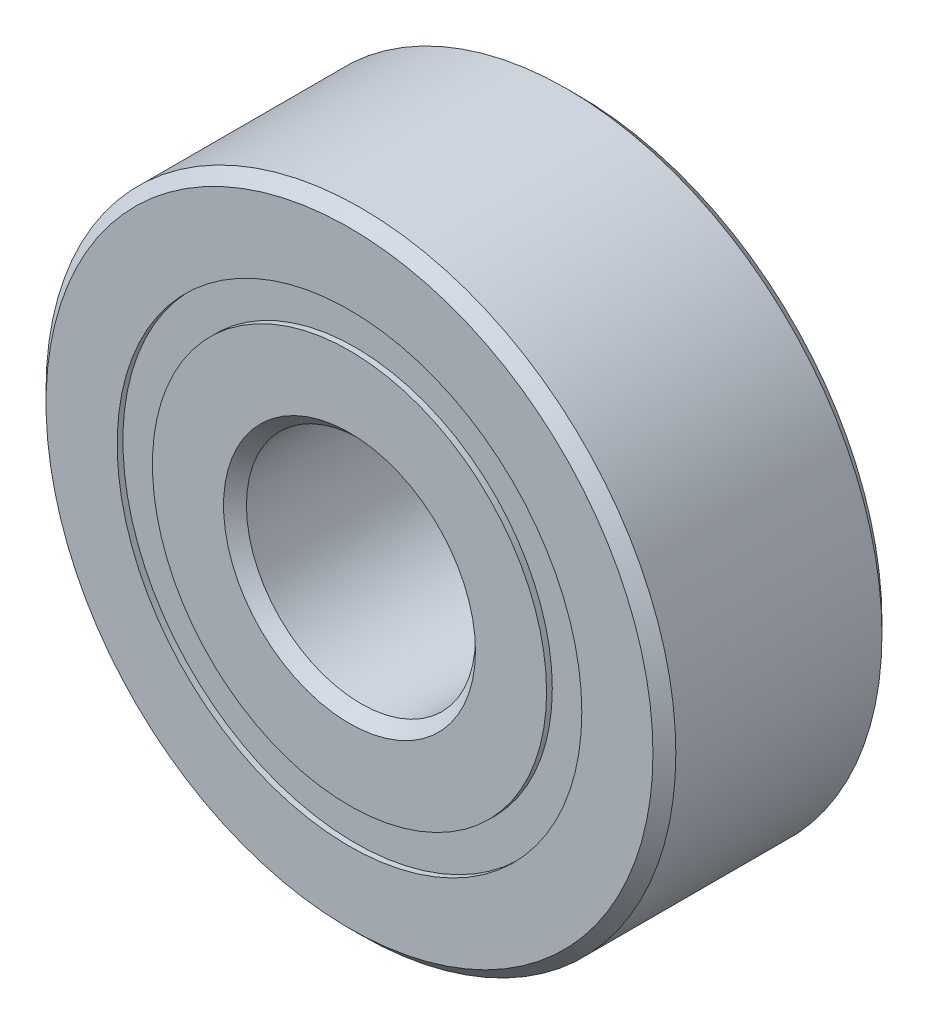
ISO-10303-21;
HEADER;
FILE_DESCRIPTION(('STEP AP214'),'2;1');
FILE_NAME('part.step','',(''),(''),'','','');
FILE_SCHEMA(('AUTOMOTIVE_DESIGN { 1 0 10303 214 1 1 1 1 }'));
ENDSEC;
DATA;
#1=APPLICATION_CONTEXT('core data for automotive mechanical design processes');
#2=APPLICATION_PROTOCOL_DEFINITION('international standard','automotive_design',2000,#1);
#3=PRODUCT_CONTEXT('',#1,'mechanical');
#4=PRODUCT('Part','Part','',(#3));
#5=PRODUCT_RELATED_PRODUCT_CATEGORY('part','',(#4));
#6=PRODUCT_DEFINITION_FORMATION('','',#4);
#7=PRODUCT_DEFINITION_CONTEXT('part definition',#1,'design');
#8=PRODUCT_DEFINITION('design','',#6,#7);
#9=PRODUCT_DEFINITION_SHAPE('','',#8);
#10=(LENGTH_UNIT() NAMED_UNIT(*) SI_UNIT(.MILLI.,.METRE.));
#11=(NAMED_UNIT(*) PLANE_ANGLE_UNIT() SI_UNIT($,.RADIAN.));
#12=(NAMED_UNIT(*) SI_UNIT($,.STERADIAN.) SOLID_ANGLE_UNIT());
#13=UNCERTAINTY_MEASURE_WITH_UNIT(LENGTH_MEASURE(1.E-05),#10,'distance_accuracy_value','');
#14=(GEOMETRIC_REPRESENTATION_CONTEXT(3) GLOBAL_UNCERTAINTY_ASSIGNED_CONTEXT((#13)) GLOBAL_UNIT_ASSIGNED_CONTEXT((#10,
#11,#12)) REPRESENTATION_CONTEXT('',''));
#15=CARTESIAN_POINT('',(0.,0.,0.));
#16=DIRECTION('',(0.,0.,1.));
#17=DIRECTION('',(1.,0.,0.));
#18=AXIS2_PLACEMENT_3D('',#15,#16,#17);
#19=CARTESIAN_POINT('',(0.,4.05769230769231,-1.9));
#20=DIRECTION('',(0.,0.,1.));
#21=DIRECTION('',(1.,0.,0.));
#22=AXIS2_PLACEMENT_3D('',#19,#20,#21);
#23=PLANE('',#22);
#24=CARTESIAN_POINT('',(0.,0.,-1.9));
#25=DIRECTION('',(0.,0.,1.));
#26=DIRECTION('',(1.,0.,0.));
#27=AXIS2_PLACEMENT_3D('',#24,#25,#26);
#28=CIRCLE('',#27,4.05769230769231);
#29=CARTESIAN_POINT('',(4.05769230769231,0.,-1.9));
#30=VERTEX_POINT('',#29);
#31=EDGE_CURVE('E59',#30,#30,#28,.T.);
#32=ORIENTED_EDGE('',*,*,#31,.F.);
#33=EDGE_LOOP('',(#32));
#34=FACE_BOUND('',#33,.T.);
#35=CARTESIAN_POINT('',(0.,0.,-1.9));
#36=DIRECTION('',(0.,0.,1.));
#37=DIRECTION('',(1.,0.,0.));
#38=AXIS2_PLACEMENT_3D('',#35,#36,#37);
#39=CIRCLE('',#38,3.44230769230769);
#40=CARTESIAN_POINT('',(3.44230769230769,0.,-1.9));
#41=VERTEX_POINT('',#40);
#42=EDGE_CURVE('E11',#41,#41,#39,.T.);
#43=ORIENTED_EDGE('',*,*,#42,.T.);
#44=EDGE_LOOP('',(#43));
#45=FACE_BOUND('',#44,.T.);
#46=ADVANCED_FACE('F45',(#34,#45),#23,.F.);
#47=CARTESIAN_POINT('',(0.,0.,2.));
#48=DIRECTION('',(0.,0.,1.));
#49=DIRECTION('',(1.,0.,0.));
#50=AXIS2_PLACEMENT_3D('',#47,#48,#49);
#51=CYLINDRICAL_SURFACE('',#50,3.44230769230769);
#52=ORIENTED_EDGE('',*,*,#42,.F.);
#53=EDGE_LOOP('',(#52));
#54=FACE_BOUND('',#53,.T.);
#55=CARTESIAN_POINT('',(0.,0.,-0.940637025107528));
#56=DIRECTION('',(0.,0.,1.));
#57=DIRECTION('',(1.,0.,0.));
#58=AXIS2_PLACEMENT_3D('',#55,#56,#57);
#59=CIRCLE('',#58,3.44230769230769);
#60=CARTESIAN_POINT('',(3.44230769230769,0.,-0.940637025107528));
#61=VERTEX_POINT('',#60);
#62=EDGE_CURVE('E51',#61,#61,#59,.T.);
#63=ORIENTED_EDGE('',*,*,#62,.T.);
#64=EDGE_LOOP('',(#63));
#65=FACE_BOUND('',#64,.T.);
#66=ADVANCED_FACE('F68',(#54,#65),#51,.F.);
#67=CARTESIAN_POINT('',(0.,4.05769230769231,-0.940637025107528));
#68=DIRECTION('',(0.,0.,-1.));
#69=DIRECTION('',(-1.,0.,0.));
#70=AXIS2_PLACEMENT_3D('',#67,#68,#69);
#71=PLANE('',#70);
#72=ORIENTED_EDGE('',*,*,#62,.F.);
#73=EDGE_LOOP('',(#72));
#74=FACE_BOUND('',#73,.T.);
#75=CARTESIAN_POINT('',(0.,0.,-0.940637025107528));
#76=DIRECTION('',(0.,0.,1.));
#77=DIRECTION('',(1.,0.,0.));
#78=AXIS2_PLACEMENT_3D('',#75,#76,#77);
#79=CIRCLE('',#78,4.05769230769231);
#80=CARTESIAN_POINT('',(4.05769230769231,0.,-0.940637025107528));
#81=VERTEX_POINT('',#80);
#82=EDGE_CURVE('E55',#81,#81,#79,.T.);
#83=ORIENTED_EDGE('',*,*,#82,.T.);
#84=EDGE_LOOP('',(#83));
#85=FACE_BOUND('',#84,.T.);
#86=ADVANCED_FACE('F72',(#74,#85),#71,.F.);
#87=CARTESIAN_POINT('',(0.,0.,2.));
#88=DIRECTION('',(0.,0.,1.));
#89=DIRECTION('',(1.,0.,0.));
#90=AXIS2_PLACEMENT_3D('',#87,#88,#89);
#91=CYLINDRICAL_SURFACE('',#90,4.05769230769231);
#92=ORIENTED_EDGE('',*,*,#82,.F.);
#93=EDGE_LOOP('',(#92));
#94=FACE_BOUND('',#93,.T.);
#95=ORIENTED_EDGE('',*,*,#31,.T.);
#96=EDGE_LOOP('',(#95));
#97=FACE_BOUND('',#96,.T.);
#98=ADVANCED_FACE('F65',(#94,#97),#91,.T.);
#99=CLOSED_SHELL('',(#46,#66,#86,#98));
#100=MANIFOLD_SOLID_BREP('B2',#99);
#101=CARTESIAN_POINT('',(0.,4.05769230769231,1.9));
#102=DIRECTION('',(0.,0.,-1.));
#103=DIRECTION('',(-1.,0.,0.));
#104=AXIS2_PLACEMENT_3D('',#101,#102,#103);
#105=PLANE('',#104);
#106=CARTESIAN_POINT('',(0.,0.,1.9));
#107=DIRECTION('',(0.,0.,1.));
#108=DIRECTION('',(1.,0.,0.));
#109=AXIS2_PLACEMENT_3D('',#106,#107,#108);
#110=CIRCLE('',#109,3.44230769230769);
#111=CARTESIAN_POINT('',(3.44230769230769,0.,1.9));
#112=VERTEX_POINT('',#111);
#113=EDGE_CURVE('E44',#112,#112,#110,.T.);
#114=ORIENTED_EDGE('',*,*,#113,.F.);
#115=EDGE_LOOP('',(#114));
#116=FACE_BOUND('',#115,.T.);
#117=CARTESIAN_POINT('',(0.,0.,1.9));
#118=DIRECTION('',(0.,0.,1.));
#119=DIRECTION('',(1.,0.,0.));
#120=AXIS2_PLACEMENT_3D('',#117,#118,#119);
#121=CIRCLE('',#120,4.05769230769231);
#122=CARTESIAN_POINT('',(4.05769230769231,0.,1.9));
#123=VERTEX_POINT('',#122);
#124=EDGE_CURVE('E126',#123,#123,#121,.T.);
#125=ORIENTED_EDGE('',*,*,#124,.T.);
#126=EDGE_LOOP('',(#125));
#127=FACE_BOUND('',#126,.T.);
#128=ADVANCED_FACE('F112',(#116,#127),#105,.F.);
#129=CARTESIAN_POINT('',(0.,0.,2.));
#130=DIRECTION('',(0.,0.,1.));
#131=DIRECTION('',(1.,0.,0.));
#132=AXIS2_PLACEMENT_3D('',#129,#130,#131);
#133=CYLINDRICAL_SURFACE('',#132,3.44230769230769);
#134=CARTESIAN_POINT('',(0.,0.,0.940637025107528));
#135=DIRECTION('',(0.,0.,1.));
#136=DIRECTION('',(1.,0.,0.));
#137=AXIS2_PLACEMENT_3D('',#134,#135,#136);
#138=CIRCLE('',#137,3.44230769230769);
#139=CARTESIAN_POINT('',(3.44230769230769,0.,0.940637025107528));
#140=VERTEX_POINT('',#139);
#141=EDGE_CURVE('E118',#140,#140,#138,.T.);
#142=ORIENTED_EDGE('',*,*,#141,.F.);
#143=EDGE_LOOP('',(#142));
#144=FACE_BOUND('',#143,.T.);
#145=ORIENTED_EDGE('',*,*,#113,.T.);
#146=EDGE_LOOP('',(#145));
#147=FACE_BOUND('',#146,.T.);
#148=ADVANCED_FACE('F141',(#144,#147),#133,.F.);
#149=CARTESIAN_POINT('',(0.,4.05769230769231,0.940637025107528));
#150=DIRECTION('',(0.,0.,1.));
#151=DIRECTION('',(1.,0.,0.));
#152=AXIS2_PLACEMENT_3D('',#149,#150,#151);
#153=PLANE('',#152);
#154=CARTESIAN_POINT('',(0.,0.,0.940637025107528));
#155=DIRECTION('',(0.,0.,1.));
#156=DIRECTION('',(1.,0.,0.));
#157=AXIS2_PLACEMENT_3D('',#154,#155,#156);
#158=CIRCLE('',#157,4.05769230769231);
#159=CARTESIAN_POINT('',(4.05769230769231,0.,0.940637025107528));
#160=VERTEX_POINT('',#159);
#161=EDGE_CURVE('E122',#160,#160,#158,.T.);
#162=ORIENTED_EDGE('',*,*,#161,.F.);
#163=EDGE_LOOP('',(#162));
#164=FACE_BOUND('',#163,.T.);
#165=ORIENTED_EDGE('',*,*,#141,.T.);
#166=EDGE_LOOP('',(#165));
#167=FACE_BOUND('',#166,.T.);
#168=ADVANCED_FACE('F136',(#164,#167),#153,.F.);
#169=CARTESIAN_POINT('',(0.,0.,2.));
#170=DIRECTION('',(0.,0.,1.));
#171=DIRECTION('',(1.,0.,0.));
#172=AXIS2_PLACEMENT_3D('',#169,#170,#171);
#173=CYLINDRICAL_SURFACE('',#172,4.05769230769231);
#174=ORIENTED_EDGE('',*,*,#124,.F.);
#175=EDGE_LOOP('',(#174));
#176=FACE_BOUND('',#175,.T.);
#177=ORIENTED_EDGE('',*,*,#161,.T.);
#178=EDGE_LOOP('',(#177));
#179=FACE_BOUND('',#178,.T.);
#180=ADVANCED_FACE('F133',(#176,#179),#173,.T.);
#181=CLOSED_SHELL('',(#128,#148,#168,#180));
#182=MANIFOLD_SOLID_BREP('B6',#181);
#183=CARTESIAN_POINT('',(-1.87499999999996,3.24759526419167,0.));
#184=DIRECTION('',(0.,0.,1.));
#185=DIRECTION('',(-0.499999999999989,0.866025403784445,0.));
#186=AXIS2_PLACEMENT_3D('',#183,#184,#185);
#187=SPHERICAL_SURFACE('',#186,0.940637025107528);
#188=CARTESIAN_POINT('',(-1.87499999999996,3.24759526419167,0.940637025107528));
#189=VERTEX_POINT('',#188);
#190=VERTEX_LOOP('',#189);
#191=FACE_BOUND('',#190,.T.);
#192=ADVANCED_FACE('F179',(#191),#187,.T.);
#193=CLOSED_SHELL('',(#192));
#194=MANIFOLD_SOLID_BREP('B39',#193);
#195=CARTESIAN_POINT('',(-3.24759526419162,1.87500000000004,0.));
#196=DIRECTION('',(0.,0.,1.));
#197=DIRECTION('',(-0.866025403784433,0.50000000000001,0.));
#198=AXIS2_PLACEMENT_3D('',#195,#196,#197);
#199=SPHERICAL_SURFACE('',#198,0.940637025107528);
#200=CARTESIAN_POINT('',(-3.24759526419162,1.87500000000004,0.940637025107528));
#201=VERTEX_POINT('',#200);
#202=VERTEX_LOOP('',#201);
#203=FACE_BOUND('',#202,.T.);
#204=ADVANCED_FACE('F199',(#203),#199,.T.);
#205=CLOSED_SHELL('',(#204));
#206=MANIFOLD_SOLID_BREP('B108',#205);
#207=CARTESIAN_POINT('',(-3.75,0.,0.));
#208=DIRECTION('',(0.,0.,1.));
#209=DIRECTION('',(-1.,0.,0.));
#210=AXIS2_PLACEMENT_3D('',#207,#208,#209);
#211=SPHERICAL_SURFACE('',#210,0.940637025107528);
#212=CARTESIAN_POINT('',(-3.75,0.,0.940637025107528));
#213=VERTEX_POINT('',#212);
#214=VERTEX_LOOP('',#213);
#215=FACE_BOUND('',#214,.T.);
#216=ADVANCED_FACE('F219',(#215),#211,.T.);
#217=CLOSED_SHELL('',(#216));
#218=MANIFOLD_SOLID_BREP('B175',#217);
#219=CARTESIAN_POINT('',(-3.24759526419166,-1.87499999999997,0.));
#220=DIRECTION('',(0.,0.,1.));
#221=DIRECTION('',(-0.866025403784443,-0.499999999999992,0.));
#222=AXIS2_PLACEMENT_3D('',#219,#220,#221);
#223=SPHERICAL_SURFACE('',#222,0.940637025107528);
#224=CARTESIAN_POINT('',(-3.24759526419166,-1.87499999999997,0.940637025107528));
#225=VERTEX_POINT('',#224);
#226=VERTEX_LOOP('',#225);
#227=FACE_BOUND('',#226,.T.);
#228=ADVANCED_FACE('F239',(#227),#223,.T.);
#229=CLOSED_SHELL('',(#228));
#230=MANIFOLD_SOLID_BREP('B195',#229);
#231=CARTESIAN_POINT('',(-1.87500000000003,-3.24759526419163,0.));
#232=DIRECTION('',(0.,0.,1.));
#233=DIRECTION('',(-0.500000000000007,-0.866025403784435,0.));
#234=AXIS2_PLACEMENT_3D('',#231,#232,#233);
#235=SPHERICAL_SURFACE('',#234,0.940637025107528);
#236=CARTESIAN_POINT('',(-1.87500000000003,-3.24759526419163,0.940637025107528));
#237=VERTEX_POINT('',#236);
#238=VERTEX_LOOP('',#237);
#239=FACE_BOUND('',#238,.T.);
#240=ADVANCED_FACE('F259',(#239),#235,.T.);
#241=CLOSED_SHELL('',(#240));
#242=MANIFOLD_SOLID_BREP('B215',#241);
#243=CARTESIAN_POINT('',(0.,-3.75,0.));
#244=DIRECTION('',(0.,0.,1.));
#245=DIRECTION('',(0.,-1.,0.));
#246=AXIS2_PLACEMENT_3D('',#243,#244,#245);
#247=SPHERICAL_SURFACE('',#246,0.940637025107528);
#248=CARTESIAN_POINT('',(0.,-3.75,0.940637025107528));
#249=VERTEX_POINT('',#248);
#250=VERTEX_LOOP('',#249);
#251=FACE_BOUND('',#250,.T.);
#252=ADVANCED_FACE('F279',(#251),#247,.T.);
#253=CLOSED_SHELL('',(#252));
#254=MANIFOLD_SOLID_BREP('B235',#253);
#255=CARTESIAN_POINT('',(1.87499999999998,-3.24759526419166,0.));
#256=DIRECTION('',(0.,0.,1.));
#257=DIRECTION('',(0.499999999999995,-0.866025403784442,0.));
#258=AXIS2_PLACEMENT_3D('',#255,#256,#257);
#259=SPHERICAL_SURFACE('',#258,0.940637025107528);
#260=CARTESIAN_POINT('',(1.87499999999998,-3.24759526419166,0.940637025107528));
#261=VERTEX_POINT('',#260);
#262=VERTEX_LOOP('',#261);
#263=FACE_BOUND('',#262,.T.);
#264=ADVANCED_FACE('F299',(#263),#259,.T.);
#265=CLOSED_SHELL('',(#264));
#266=MANIFOLD_SOLID_BREP('B255',#265);
#267=CARTESIAN_POINT('',(3.24759526419164,-1.87500000000002,0.));
#268=DIRECTION('',(0.,0.,1.));
#269=DIRECTION('',(0.866025403784436,-0.500000000000004,0.));
#270=AXIS2_PLACEMENT_3D('',#267,#268,#269);
#271=SPHERICAL_SURFACE('',#270,0.940637025107528);
#272=CARTESIAN_POINT('',(3.24759526419164,-1.87500000000002,0.940637025107528));
#273=VERTEX_POINT('',#272);
#274=VERTEX_LOOP('',#273);
#275=FACE_BOUND('',#274,.T.);
#276=ADVANCED_FACE('F319',(#275),#271,.T.);
#277=CLOSED_SHELL('',(#276));
#278=MANIFOLD_SOLID_BREP('B275',#277);
#279=CARTESIAN_POINT('',(3.75,0.,0.));
#280=DIRECTION('',(0.,0.,1.));
#281=DIRECTION('',(1.,0.,0.));
#282=AXIS2_PLACEMENT_3D('',#279,#280,#281);
#283=SPHERICAL_SURFACE('',#282,0.940637025107528);
#284=CARTESIAN_POINT('',(3.75,0.,0.940637025107528));
#285=VERTEX_POINT('',#284);
#286=VERTEX_LOOP('',#285);
#287=FACE_BOUND('',#286,.T.);
#288=ADVANCED_FACE('F339',(#287),#283,.T.);
#289=CLOSED_SHELL('',(#288));
#290=MANIFOLD_SOLID_BREP('B295',#289);
#291=CARTESIAN_POINT('',(3.24759526419165,1.87499999999999,0.));
#292=DIRECTION('',(0.,0.,1.));
#293=DIRECTION('',(0.86602540378444,0.499999999999998,0.));
#294=AXIS2_PLACEMENT_3D('',#291,#292,#293);
#295=SPHERICAL_SURFACE('',#294,0.940637025107528);
#296=CARTESIAN_POINT('',(3.24759526419165,1.87499999999999,0.940637025107528));
#297=VERTEX_POINT('',#296);
#298=VERTEX_LOOP('',#297);
#299=FACE_BOUND('',#298,.T.);
#300=ADVANCED_FACE('F359',(#299),#295,.T.);
#301=CLOSED_SHELL('',(#300));
#302=MANIFOLD_SOLID_BREP('B315',#301);
#303=CARTESIAN_POINT('',(1.875,3.24759526419164,0.));
#304=DIRECTION('',(0.,0.,1.));
#305=DIRECTION('',(0.500000000000001,0.866025403784438,0.));
#306=AXIS2_PLACEMENT_3D('',#303,#304,#305);
#307=SPHERICAL_SURFACE('',#306,0.940637025107528);
#308=CARTESIAN_POINT('',(1.875,3.24759526419164,0.940637025107528));
#309=VERTEX_POINT('',#308);
#310=VERTEX_LOOP('',#309);
#311=FACE_BOUND('',#310,.T.);
#312=ADVANCED_FACE('F379',(#311),#307,.T.);
#313=CLOSED_SHELL('',(#312));
#314=MANIFOLD_SOLID_BREP('B335',#313);
#315=CARTESIAN_POINT('',(0.,3.75,0.));
#316=DIRECTION('',(0.,0.,1.));
#317=DIRECTION('',(0.,1.,0.));
#318=AXIS2_PLACEMENT_3D('',#315,#316,#317);
#319=SPHERICAL_SURFACE('',#318,0.940637025107528);
#320=CARTESIAN_POINT('',(0.,3.75,0.940637025107528));
#321=VERTEX_POINT('',#320);
#322=VERTEX_LOOP('',#321);
#323=FACE_BOUND('',#322,.T.);
#324=ADVANCED_FACE('F401',(#323),#319,.T.);
#325=CLOSED_SHELL('',(#324));
#326=MANIFOLD_SOLID_BREP('B355',#325);
#327=CARTESIAN_POINT('',(0.,3.44230769230769,2.));
#328=DIRECTION('',(0.,0.,-1.));
#329=DIRECTION('',(-1.,0.,0.));
#330=AXIS2_PLACEMENT_3D('',#327,#328,#329);
#331=PLANE('',#330);
#332=CARTESIAN_POINT('',(0.,0.,2.));
#333=DIRECTION('',(0.,0.,1.));
#334=DIRECTION('',(1.,0.,0.));
#335=AXIS2_PLACEMENT_3D('',#332,#333,#334);
#336=CIRCLE('',#335,2.2);
#337=CARTESIAN_POINT('',(2.2,0.,2.));
#338=VERTEX_POINT('',#337);
#339=EDGE_CURVE('E448',#338,#338,#336,.T.);
#340=ORIENTED_EDGE('',*,*,#339,.F.);
#341=EDGE_LOOP('',(#340));
#342=FACE_BOUND('',#341,.T.);
#343=CARTESIAN_POINT('',(0.,0.,2.));
#344=DIRECTION('',(0.,0.,1.));
#345=DIRECTION('',(1.,0.,0.));
#346=AXIS2_PLACEMENT_3D('',#343,#344,#345);
#347=CIRCLE('',#346,3.44230769230769);
#348=CARTESIAN_POINT('',(3.44230769230769,0.,2.));
#349=VERTEX_POINT('',#348);
#350=EDGE_CURVE('E400',#349,#349,#347,.T.);
#351=ORIENTED_EDGE('',*,*,#350,.T.);
#352=EDGE_LOOP('',(#351));
#353=FACE_BOUND('',#352,.T.);
#354=ADVANCED_FACE('F420',(#342,#353),#331,.F.);
#355=CARTESIAN_POINT('',(0.,0.,2.));
#356=DIRECTION('',(0.,0.,1.));
#357=DIRECTION('',(1.,0.,0.));
#358=AXIS2_PLACEMENT_3D('',#355,#356,#357);
#359=CYLINDRICAL_SURFACE('',#358,3.44230769230769);
#360=ORIENTED_EDGE('',*,*,#350,.F.);
#361=EDGE_LOOP('',(#360));
#362=FACE_BOUND('',#361,.T.);
#363=CARTESIAN_POINT('',(0.,0.,0.888888888888889));
#364=DIRECTION('',(0.,0.,1.));
#365=DIRECTION('',(1.,0.,0.));
#366=AXIS2_PLACEMENT_3D('',#363,#364,#365);
#367=CIRCLE('',#366,3.44230769230769);
#368=CARTESIAN_POINT('',(3.44230769230769,0.,0.888888888888889));
#369=VERTEX_POINT('',#368);
#370=EDGE_CURVE('E426',#369,#369,#367,.T.);
#371=ORIENTED_EDGE('',*,*,#370,.T.);
#372=EDGE_LOOP('',(#371));
#373=FACE_BOUND('',#372,.T.);
#374=ADVANCED_FACE('F455',(#362,#373),#359,.T.);
#375=CARTESIAN_POINT('',(0.,0.,0.));
#376=DIRECTION('',(0.,0.,1.));
#377=DIRECTION('',(1.,0.,0.));
#378=AXIS2_PLACEMENT_3D('',#375,#376,#377);
#379=TOROIDAL_SURFACE('',#378,3.75,0.940637025107527);
#380=ORIENTED_EDGE('',*,*,#370,.F.);
#381=EDGE_LOOP('',(#380));
#382=FACE_BOUND('',#381,.T.);
#383=CARTESIAN_POINT('',(0.,0.,-0.88888888888889));
#384=DIRECTION('',(0.,0.,1.));
#385=DIRECTION('',(1.,0.,0.));
#386=AXIS2_PLACEMENT_3D('',#383,#384,#385);
#387=CIRCLE('',#386,3.44230769230769);
#388=CARTESIAN_POINT('',(3.44230769230769,0.,-0.88888888888889));
#389=VERTEX_POINT('',#388);
#390=EDGE_CURVE('E430',#389,#389,#387,.T.);
#391=ORIENTED_EDGE('',*,*,#390,.T.);
#392=EDGE_LOOP('',(#391));
#393=FACE_BOUND('',#392,.T.);
#394=ADVANCED_FACE('F459',(#382,#393),#379,.F.);
#395=CARTESIAN_POINT('',(0.,0.,2.));
#396=DIRECTION('',(0.,0.,1.));
#397=DIRECTION('',(1.,0.,0.));
#398=AXIS2_PLACEMENT_3D('',#395,#396,#397);
#399=CYLINDRICAL_SURFACE('',#398,3.44230769230769);
#400=ORIENTED_EDGE('',*,*,#390,.F.);
#401=EDGE_LOOP('',(#400));
#402=FACE_BOUND('',#401,.T.);
#403=CARTESIAN_POINT('',(0.,0.,-2.));
#404=DIRECTION('',(0.,0.,1.));
#405=DIRECTION('',(1.,0.,0.));
#406=AXIS2_PLACEMENT_3D('',#403,#404,#405);
#407=CIRCLE('',#406,3.44230769230769);
#408=CARTESIAN_POINT('',(3.44230769230769,0.,-2.));
#409=VERTEX_POINT('',#408);
#410=EDGE_CURVE('E434',#409,#409,#407,.T.);
#411=ORIENTED_EDGE('',*,*,#410,.T.);
#412=EDGE_LOOP('',(#411));
#413=FACE_BOUND('',#412,.T.);
#414=ADVANCED_FACE('F464',(#402,#413),#399,.T.);
#415=CARTESIAN_POINT('',(0.,2.2,-2.));
#416=DIRECTION('',(0.,0.,1.));
#417=DIRECTION('',(1.,0.,0.));
#418=AXIS2_PLACEMENT_3D('',#415,#416,#417);
#419=PLANE('',#418);
#420=ORIENTED_EDGE('',*,*,#410,.F.);
#421=EDGE_LOOP('',(#420));
#422=FACE_BOUND('',#421,.T.);
#423=CARTESIAN_POINT('',(0.,0.,-2.));
#424=DIRECTION('',(0.,0.,1.));
#425=DIRECTION('',(1.,0.,0.));
#426=AXIS2_PLACEMENT_3D('',#423,#424,#425);
#427=CIRCLE('',#426,2.2);
#428=CARTESIAN_POINT('',(2.2,0.,-2.));
#429=VERTEX_POINT('',#428);
#430=EDGE_CURVE('E439',#429,#429,#427,.T.);
#431=ORIENTED_EDGE('',*,*,#430,.T.);
#432=EDGE_LOOP('',(#431));
#433=FACE_BOUND('',#432,.T.);
#434=ADVANCED_FACE('F470',(#422,#433),#419,.F.);
#435=CARTESIAN_POINT('',(0.,0.,-1.8));
#436=DIRECTION('',(0.,0.,-1.));
#437=DIRECTION('',(-1.,0.,0.));
#438=AXIS2_PLACEMENT_3D('',#435,#436,#437);
#439=CONICAL_SURFACE('',#438,2.,0.785398163397454);
#440=ORIENTED_EDGE('',*,*,#430,.F.);
#441=EDGE_LOOP('',(#440));
#442=FACE_BOUND('',#441,.T.);
#443=CARTESIAN_POINT('',(0.,0.,-1.8));
#444=DIRECTION('',(0.,0.,1.));
#445=DIRECTION('',(1.,0.,0.));
#446=AXIS2_PLACEMENT_3D('',#443,#444,#445);
#447=CIRCLE('',#446,2.);
#448=CARTESIAN_POINT('',(2.,0.,-1.8));
#449=VERTEX_POINT('',#448);
#450=EDGE_CURVE('E442',#449,#449,#447,.T.);
#451=ORIENTED_EDGE('',*,*,#450,.T.);
#452=EDGE_LOOP('',(#451));
#453=FACE_BOUND('',#452,.T.);
#454=ADVANCED_FACE('F474',(#442,#453),#439,.F.);
#455=CARTESIAN_POINT('',(0.,0.,2.));
#456=DIRECTION('',(0.,0.,1.));
#457=DIRECTION('',(1.,0.,0.));
#458=AXIS2_PLACEMENT_3D('',#455,#456,#457);
#459=CYLINDRICAL_SURFACE('',#458,2.);
#460=ORIENTED_EDGE('',*,*,#450,.F.);
#461=EDGE_LOOP('',(#460));
#462=FACE_BOUND('',#461,.T.);
#463=CARTESIAN_POINT('',(0.,0.,1.8));
#464=DIRECTION('',(0.,0.,1.));
#465=DIRECTION('',(1.,0.,0.));
#466=AXIS2_PLACEMENT_3D('',#463,#464,#465);
#467=CIRCLE('',#466,2.);
#468=CARTESIAN_POINT('',(2.,0.,1.8));
#469=VERTEX_POINT('',#468);
#470=EDGE_CURVE('E445',#469,#469,#467,.T.);
#471=ORIENTED_EDGE('',*,*,#470,.T.);
#472=EDGE_LOOP('',(#471));
#473=FACE_BOUND('',#472,.T.);
#474=ADVANCED_FACE('F478',(#462,#473),#459,.F.);
#475=CARTESIAN_POINT('',(0.,0.,2.));
#476=DIRECTION('',(0.,0.,1.));
#477=DIRECTION('',(1.,0.,0.));
#478=AXIS2_PLACEMENT_3D('',#475,#476,#477);
#479=CONICAL_SURFACE('',#478,2.2,0.785398163397443);
#480=ORIENTED_EDGE('',*,*,#470,.F.);
#481=EDGE_LOOP('',(#480));
#482=FACE_BOUND('',#481,.T.);
#483=ORIENTED_EDGE('',*,*,#339,.T.);
#484=EDGE_LOOP('',(#483));
#485=FACE_BOUND('',#484,.T.);
#486=ADVANCED_FACE('F452',(#482,#485),#479,.F.);
#487=CLOSED_SHELL('',(#354,#374,#394,#414,#434,#454,#474,#486));
#488=MANIFOLD_SOLID_BREP('B375',#487);
#489=CARTESIAN_POINT('',(0.,0.,1.8));
#490=DIRECTION('',(0.,0.,-1.));
#491=DIRECTION('',(-1.,0.,0.));
#492=AXIS2_PLACEMENT_3D('',#489,#490,#491);
#493=CONICAL_SURFACE('',#492,5.5,0.785398163397449);
#494=CARTESIAN_POINT('',(0.,0.,2.));
#495=DIRECTION('',(0.,0.,1.));
#496=DIRECTION('',(1.,0.,0.));
#497=AXIS2_PLACEMENT_3D('',#494,#495,#496);
#498=CIRCLE('',#497,5.3);
#499=CARTESIAN_POINT('',(5.3,0.,2.));
#500=VERTEX_POINT('',#499);
#501=EDGE_CURVE('E577',#500,#500,#498,.T.);
#502=ORIENTED_EDGE('',*,*,#501,.F.);
#503=EDGE_LOOP('',(#502));
#504=FACE_BOUND('',#503,.T.);
#505=CARTESIAN_POINT('',(0.,0.,1.8));
#506=DIRECTION('',(0.,0.,1.));
#507=DIRECTION('',(1.,0.,0.));
#508=AXIS2_PLACEMENT_3D('',#505,#506,#507);
#509=CIRCLE('',#508,5.5);
#510=CARTESIAN_POINT('',(5.5,0.,1.8));
#511=VERTEX_POINT('',#510);
#512=EDGE_CURVE('E419',#511,#511,#509,.T.);
#513=ORIENTED_EDGE('',*,*,#512,.T.);
#514=EDGE_LOOP('',(#513));
#515=FACE_BOUND('',#514,.T.);
#516=ADVANCED_FACE('F541',(#504,#515),#493,.T.);
#517=CARTESIAN_POINT('',(0.,0.,2.));
#518=DIRECTION('',(0.,0.,1.));
#519=DIRECTION('',(1.,0.,0.));
#520=AXIS2_PLACEMENT_3D('',#517,#518,#519);
#521=CYLINDRICAL_SURFACE('',#520,5.5);
#522=ORIENTED_EDGE('',*,*,#512,.F.);
#523=EDGE_LOOP('',(#522));
#524=FACE_BOUND('',#523,.T.);
#525=CARTESIAN_POINT('',(0.,0.,-1.8));
#526=DIRECTION('',(0.,0.,1.));
#527=DIRECTION('',(1.,0.,0.));
#528=AXIS2_PLACEMENT_3D('',#525,#526,#527);
#529=CIRCLE('',#528,5.5);
#530=CARTESIAN_POINT('',(5.5,0.,-1.8));
#531=VERTEX_POINT('',#530);
#532=EDGE_CURVE('E548',#531,#531,#529,.T.);
#533=ORIENTED_EDGE('',*,*,#532,.T.);
#534=EDGE_LOOP('',(#533));
#535=FACE_BOUND('',#534,.T.);
#536=ADVANCED_FACE('F584',(#524,#535),#521,.T.);
#537=CARTESIAN_POINT('',(0.,0.,-2.));
#538=DIRECTION('',(0.,0.,1.));
#539=DIRECTION('',(1.,0.,0.));
#540=AXIS2_PLACEMENT_3D('',#537,#538,#539);
#541=CONICAL_SURFACE('',#540,5.3,0.78539816339745);
#542=ORIENTED_EDGE('',*,*,#532,.F.);
#543=EDGE_LOOP('',(#542));
#544=FACE_BOUND('',#543,.T.);
#545=CARTESIAN_POINT('',(0.,0.,-2.));
#546=DIRECTION('',(0.,0.,1.));
#547=DIRECTION('',(1.,0.,0.));
#548=AXIS2_PLACEMENT_3D('',#545,#546,#547);
#549=CIRCLE('',#548,5.3);
#550=CARTESIAN_POINT('',(5.3,0.,-2.));
#551=VERTEX_POINT('',#550);
#552=EDGE_CURVE('E554',#551,#551,#549,.T.);
#553=ORIENTED_EDGE('',*,*,#552,.T.);
#554=EDGE_LOOP('',(#553));
#555=FACE_BOUND('',#554,.T.);
#556=ADVANCED_FACE('F588',(#544,#555),#541,.T.);
#557=CARTESIAN_POINT('',(0.,5.3,-2.));
#558=DIRECTION('',(0.,0.,1.));
#559=DIRECTION('',(1.,0.,0.));
#560=AXIS2_PLACEMENT_3D('',#557,#558,#559);
#561=PLANE('',#560);
#562=ORIENTED_EDGE('',*,*,#552,.F.);
#563=EDGE_LOOP('',(#562));
#564=FACE_BOUND('',#563,.T.);
#565=CARTESIAN_POINT('',(0.,0.,-2.));
#566=DIRECTION('',(0.,0.,1.));
#567=DIRECTION('',(1.,0.,0.));
#568=AXIS2_PLACEMENT_3D('',#565,#566,#567);
#569=CIRCLE('',#568,4.05769230769231);
#570=CARTESIAN_POINT('',(4.05769230769231,0.,-2.));
#571=VERTEX_POINT('',#570);
#572=EDGE_CURVE('E560',#571,#571,#569,.T.);
#573=ORIENTED_EDGE('',*,*,#572,.T.);
#574=EDGE_LOOP('',(#573));
#575=FACE_BOUND('',#574,.T.);
#576=ADVANCED_FACE('F593',(#564,#575),#561,.F.);
#577=CARTESIAN_POINT('',(0.,0.,2.));
#578=DIRECTION('',(0.,0.,1.));
#579=DIRECTION('',(1.,0.,0.));
#580=AXIS2_PLACEMENT_3D('',#577,#578,#579);
#581=CYLINDRICAL_SURFACE('',#580,4.05769230769231);
#582=ORIENTED_EDGE('',*,*,#572,.F.);
#583=EDGE_LOOP('',(#582));
#584=FACE_BOUND('',#583,.T.);
#585=CARTESIAN_POINT('',(0.,0.,-0.888888888888889));
#586=DIRECTION('',(0.,0.,1.));
#587=DIRECTION('',(1.,0.,0.));
#588=AXIS2_PLACEMENT_3D('',#585,#586,#587);
#589=CIRCLE('',#588,4.05769230769231);
#590=CARTESIAN_POINT('',(4.05769230769231,0.,-0.888888888888889));
#591=VERTEX_POINT('',#590);
#592=EDGE_CURVE('E566',#591,#591,#589,.T.);
#593=ORIENTED_EDGE('',*,*,#592,.T.);
#594=EDGE_LOOP('',(#593));
#595=FACE_BOUND('',#594,.T.);
#596=ADVANCED_FACE('F599',(#584,#595),#581,.F.);
#597=CARTESIAN_POINT('',(0.,0.,0.));
#598=DIRECTION('',(0.,0.,1.));
#599=DIRECTION('',(1.,0.,0.));
#600=AXIS2_PLACEMENT_3D('',#597,#598,#599);
#601=TOROIDAL_SURFACE('',#600,3.75,0.940637025107528);
#602=ORIENTED_EDGE('',*,*,#592,.F.);
#603=EDGE_LOOP('',(#602));
#604=FACE_BOUND('',#603,.T.);
#605=CARTESIAN_POINT('',(0.,0.,0.888888888888889));
#606=DIRECTION('',(0.,0.,1.));
#607=DIRECTION('',(1.,0.,0.));
#608=AXIS2_PLACEMENT_3D('',#605,#606,#607);
#609=CIRCLE('',#608,4.05769230769231);
#610=CARTESIAN_POINT('',(4.05769230769231,0.,0.888888888888889));
#611=VERTEX_POINT('',#610);
#612=EDGE_CURVE('E570',#611,#611,#609,.T.);
#613=ORIENTED_EDGE('',*,*,#612,.T.);
#614=EDGE_LOOP('',(#613));
#615=FACE_BOUND('',#614,.T.);
#616=ADVANCED_FACE('F603',(#604,#615),#601,.F.);
#617=CARTESIAN_POINT('',(0.,0.,2.));
#618=DIRECTION('',(0.,0.,1.));
#619=DIRECTION('',(1.,0.,0.));
#620=AXIS2_PLACEMENT_3D('',#617,#618,#619);
#621=CYLINDRICAL_SURFACE('',#620,4.05769230769231);
#622=ORIENTED_EDGE('',*,*,#612,.F.);
#623=EDGE_LOOP('',(#622));
#624=FACE_BOUND('',#623,.T.);
#625=CARTESIAN_POINT('',(0.,0.,2.));
#626=DIRECTION('',(0.,0.,1.));
#627=DIRECTION('',(1.,0.,0.));
#628=AXIS2_PLACEMENT_3D('',#625,#626,#627);
#629=CIRCLE('',#628,4.05769230769231);
#630=CARTESIAN_POINT('',(4.05769230769231,0.,2.));
#631=VERTEX_POINT('',#630);
#632=EDGE_CURVE('E574',#631,#631,#629,.T.);
#633=ORIENTED_EDGE('',*,*,#632,.T.);
#634=EDGE_LOOP('',(#633));
#635=FACE_BOUND('',#634,.T.);
#636=ADVANCED_FACE('F607',(#624,#635),#621,.F.);
#637=CARTESIAN_POINT('',(0.,5.3,2.));
#638=DIRECTION('',(0.,0.,-1.));
#639=DIRECTION('',(-1.,0.,0.));
#640=AXIS2_PLACEMENT_3D('',#637,#638,#639);
#641=PLANE('',#640);
#642=ORIENTED_EDGE('',*,*,#632,.F.);
#643=EDGE_LOOP('',(#642));
#644=FACE_BOUND('',#643,.T.);
#645=ORIENTED_EDGE('',*,*,#501,.T.);
#646=EDGE_LOOP('',(#645));
#647=FACE_BOUND('',#646,.T.);
#648=ADVANCED_FACE('F581',(#644,#647),#641,.F.);
#649=CLOSED_SHELL('',(#516,#536,#556,#576,#596,#616,#636,#648));
#650=MANIFOLD_SOLID_BREP('B395',#649);
#651=ADVANCED_BREP_SHAPE_REPRESENTATION('',(#18,#100,#182,#194,#206,#218,#230,#242,#254,#266,
#278,#290,#302,#314,#326,#488,#650),#14);
#652=SHAPE_DEFINITION_REPRESENTATION(#9,#651);
ENDSEC;
END-ISO-10303-21;
